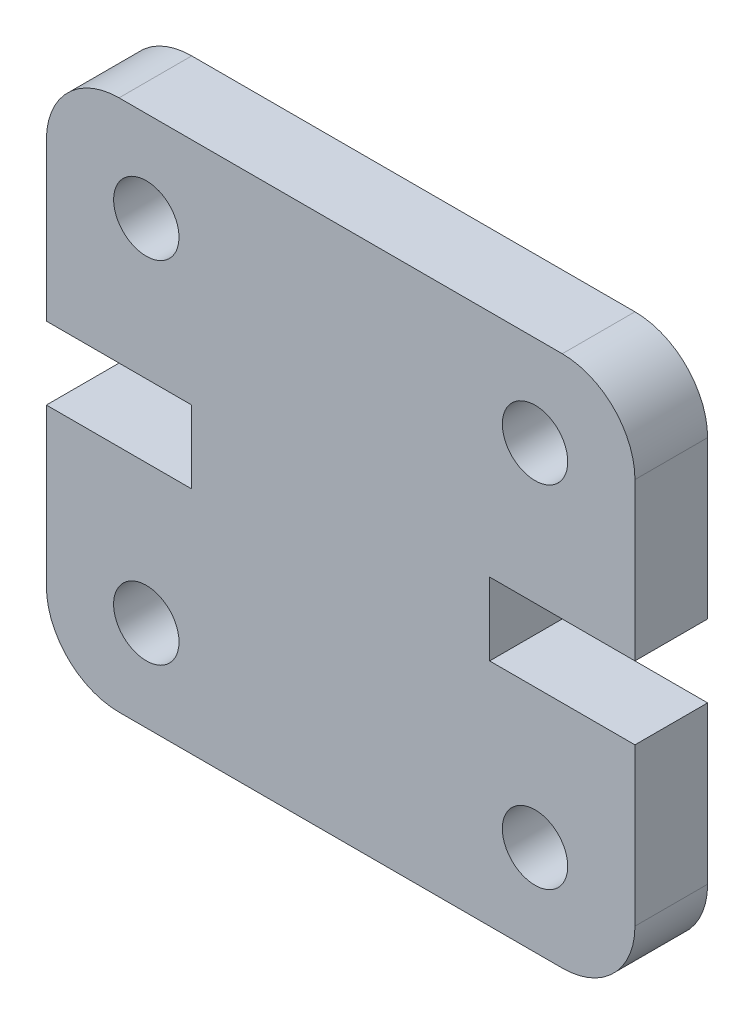
ISO-10303-21;
HEADER;
FILE_DESCRIPTION(('STEP AP214'),'2;1');
FILE_NAME('part.step','',(''),(''),'','','');
FILE_SCHEMA(('AUTOMOTIVE_DESIGN { 1 0 10303 214 1 1 1 1 }'));
ENDSEC;
DATA;
#1=APPLICATION_CONTEXT('core data for automotive mechanical design processes');
#2=APPLICATION_PROTOCOL_DEFINITION('international standard','automotive_design',2000,#1);
#3=PRODUCT_CONTEXT('',#1,'mechanical');
#4=PRODUCT('Part','Part','',(#3));
#5=PRODUCT_RELATED_PRODUCT_CATEGORY('part','',(#4));
#6=PRODUCT_DEFINITION_FORMATION('','',#4);
#7=PRODUCT_DEFINITION_CONTEXT('part definition',#1,'design');
#8=PRODUCT_DEFINITION('design','',#6,#7);
#9=PRODUCT_DEFINITION_SHAPE('','',#8);
#10=(LENGTH_UNIT() NAMED_UNIT(*) SI_UNIT(.MILLI.,.METRE.));
#11=(NAMED_UNIT(*) PLANE_ANGLE_UNIT() SI_UNIT($,.RADIAN.));
#12=(NAMED_UNIT(*) SI_UNIT($,.STERADIAN.) SOLID_ANGLE_UNIT());
#13=UNCERTAINTY_MEASURE_WITH_UNIT(LENGTH_MEASURE(1.E-05),#10,'distance_accuracy_value','');
#14=(GEOMETRIC_REPRESENTATION_CONTEXT(3) GLOBAL_UNCERTAINTY_ASSIGNED_CONTEXT((#13)) GLOBAL_UNIT_ASSIGNED_CONTEXT((#10,
#11,#12)) REPRESENTATION_CONTEXT('',''));
#15=CARTESIAN_POINT('',(0.,0.,0.));
#16=DIRECTION('',(0.,0.,1.));
#17=DIRECTION('',(1.,0.,0.));
#18=AXIS2_PLACEMENT_3D('',#15,#16,#17);
#19=CARTESIAN_POINT('',(2.,12.645,4.));
#20=DIRECTION('',(0.,0.,-1.));
#21=DIRECTION('',(-1.,0.,0.));
#22=AXIS2_PLACEMENT_3D('',#19,#20,#21);
#23=PLANE('',#22);
#24=CARTESIAN_POINT('',(13.4499999999986,12.1450000000001,4.));
#25=DIRECTION('',(0.,0.,1.));
#26=DIRECTION('',(1.,0.,0.));
#27=AXIS2_PLACEMENT_3D('',#24,#25,#26);
#28=CIRCLE('',#27,0.9);
#29=CARTESIAN_POINT('',(14.3499999999986,12.1450000000001,4.));
#30=VERTEX_POINT('',#29);
#31=EDGE_CURVE('E239',#30,#30,#28,.T.);
#32=ORIENTED_EDGE('',*,*,#31,.F.);
#33=EDGE_LOOP('',(#32));
#34=FACE_BOUND('',#33,.T.);
#35=CARTESIAN_POINT('',(2.75000000000139,12.1450000000001,4.));
#36=DIRECTION('',(0.,0.,1.));
#37=DIRECTION('',(-1.,0.,0.));
#38=AXIS2_PLACEMENT_3D('',#35,#36,#37);
#39=CIRCLE('',#38,0.9);
#40=CARTESIAN_POINT('',(1.85000000000139,12.1450000000001,4.));
#41=VERTEX_POINT('',#40);
#42=EDGE_CURVE('E245',#41,#41,#39,.T.);
#43=ORIENTED_EDGE('',*,*,#42,.F.);
#44=EDGE_LOOP('',(#43));
#45=FACE_BOUND('',#44,.T.);
#46=CARTESIAN_POINT('',(2.,12.645,4.));
#47=DIRECTION('',(0.,0.,1.));
#48=DIRECTION('',(-1.,0.,0.));
#49=AXIS2_PLACEMENT_3D('',#46,#47,#48);
#50=CIRCLE('',#49,2.);
#51=CARTESIAN_POINT('',(2.,14.645,4.));
#52=VERTEX_POINT('',#51);
#53=CARTESIAN_POINT('',(0.,12.645,4.));
#54=VERTEX_POINT('',#53);
#55=EDGE_CURVE('E248',#52,#54,#50,.T.);
#56=ORIENTED_EDGE('',*,*,#55,.T.);
#57=DIRECTION('',(0.,-1.,0.));
#58=VECTOR('',#57,1.);
#59=CARTESIAN_POINT('',(0.,8.3225,4.));
#60=LINE('',#59,#58);
#61=CARTESIAN_POINT('',(0.,8.3225,4.));
#62=VERTEX_POINT('',#61);
#63=EDGE_CURVE('E199',#54,#62,#60,.T.);
#64=ORIENTED_EDGE('',*,*,#63,.T.);
#65=DIRECTION('',(1.,0.,0.));
#66=VECTOR('',#65,1.);
#67=CARTESIAN_POINT('',(0.,8.3225,4.));
#68=LINE('',#67,#66);
#69=CARTESIAN_POINT('',(4.,8.3225,4.));
#70=VERTEX_POINT('',#69);
#71=EDGE_CURVE('E195',#62,#70,#68,.T.);
#72=ORIENTED_EDGE('',*,*,#71,.T.);
#73=DIRECTION('',(0.,-1.,0.));
#74=VECTOR('',#73,1.);
#75=CARTESIAN_POINT('',(4.,6.3225,4.));
#76=LINE('',#75,#74);
#77=CARTESIAN_POINT('',(4.,6.3225,4.));
#78=VERTEX_POINT('',#77);
#79=EDGE_CURVE('E252',#70,#78,#76,.T.);
#80=ORIENTED_EDGE('',*,*,#79,.T.);
#81=DIRECTION('',(-1.,0.,0.));
#82=VECTOR('',#81,1.);
#83=CARTESIAN_POINT('',(0.,6.3225,4.));
#84=LINE('',#83,#82);
#85=CARTESIAN_POINT('',(0.,6.3225,4.));
#86=VERTEX_POINT('',#85);
#87=EDGE_CURVE('E254',#78,#86,#84,.T.);
#88=ORIENTED_EDGE('',*,*,#87,.T.);
#89=DIRECTION('',(0.,-1.,0.));
#90=VECTOR('',#89,1.);
#91=CARTESIAN_POINT('',(0.,6.3225,4.));
#92=LINE('',#91,#90);
#93=CARTESIAN_POINT('',(0.,2.00000000000003,4.));
#94=VERTEX_POINT('',#93);
#95=EDGE_CURVE('E256',#86,#94,#92,.T.);
#96=ORIENTED_EDGE('',*,*,#95,.T.);
#97=CARTESIAN_POINT('',(2.,2.,4.));
#98=DIRECTION('',(0.,0.,1.));
#99=DIRECTION('',(1.,0.,0.));
#100=AXIS2_PLACEMENT_3D('',#97,#98,#99);
#101=CIRCLE('',#100,2.);
#102=CARTESIAN_POINT('',(2.,0.,4.));
#103=VERTEX_POINT('',#102);
#104=EDGE_CURVE('E173',#94,#103,#101,.T.);
#105=ORIENTED_EDGE('',*,*,#104,.T.);
#106=DIRECTION('',(1.,0.,0.));
#107=VECTOR('',#106,1.);
#108=CARTESIAN_POINT('',(2.,0.,4.));
#109=LINE('',#108,#107);
#110=CARTESIAN_POINT('',(14.2,0.,4.));
#111=VERTEX_POINT('',#110);
#112=EDGE_CURVE('E259',#103,#111,#109,.T.);
#113=ORIENTED_EDGE('',*,*,#112,.T.);
#114=CARTESIAN_POINT('',(14.2,2.,4.));
#115=DIRECTION('',(0.,0.,1.));
#116=DIRECTION('',(-1.,0.,0.));
#117=AXIS2_PLACEMENT_3D('',#114,#115,#116);
#118=CIRCLE('',#117,2.);
#119=CARTESIAN_POINT('',(16.2,2.00000000000003,4.));
#120=VERTEX_POINT('',#119);
#121=EDGE_CURVE('E261',#111,#120,#118,.T.);
#122=ORIENTED_EDGE('',*,*,#121,.T.);
#123=DIRECTION('',(0.,1.,0.));
#124=VECTOR('',#123,1.);
#125=CARTESIAN_POINT('',(16.2,6.3225,4.));
#126=LINE('',#125,#124);
#127=CARTESIAN_POINT('',(16.2,6.3225,4.));
#128=VERTEX_POINT('',#127);
#129=EDGE_CURVE('E263',#120,#128,#126,.T.);
#130=ORIENTED_EDGE('',*,*,#129,.T.);
#131=DIRECTION('',(-1.,0.,0.));
#132=VECTOR('',#131,1.);
#133=CARTESIAN_POINT('',(16.2,6.3225,4.));
#134=LINE('',#133,#132);
#135=CARTESIAN_POINT('',(12.2,6.3225,4.));
#136=VERTEX_POINT('',#135);
#137=EDGE_CURVE('E265',#128,#136,#134,.T.);
#138=ORIENTED_EDGE('',*,*,#137,.T.);
#139=DIRECTION('',(0.,1.,0.));
#140=VECTOR('',#139,1.);
#141=CARTESIAN_POINT('',(12.2,6.3225,4.));
#142=LINE('',#141,#140);
#143=CARTESIAN_POINT('',(12.2,8.3225,4.));
#144=VERTEX_POINT('',#143);
#145=EDGE_CURVE('E267',#136,#144,#142,.T.);
#146=ORIENTED_EDGE('',*,*,#145,.T.);
#147=DIRECTION('',(1.,0.,0.));
#148=VECTOR('',#147,1.);
#149=CARTESIAN_POINT('',(16.2,8.3225,4.));
#150=LINE('',#149,#148);
#151=CARTESIAN_POINT('',(16.2,8.3225,4.));
#152=VERTEX_POINT('',#151);
#153=EDGE_CURVE('E269',#144,#152,#150,.T.);
#154=ORIENTED_EDGE('',*,*,#153,.T.);
#155=DIRECTION('',(0.,1.,0.));
#156=VECTOR('',#155,1.);
#157=CARTESIAN_POINT('',(16.2,8.3225,4.));
#158=LINE('',#157,#156);
#159=CARTESIAN_POINT('',(16.2,12.645,4.));
#160=VERTEX_POINT('',#159);
#161=EDGE_CURVE('E271',#152,#160,#158,.T.);
#162=ORIENTED_EDGE('',*,*,#161,.T.);
#163=CARTESIAN_POINT('',(14.2,12.645,4.));
#164=DIRECTION('',(0.,0.,1.));
#165=DIRECTION('',(1.,0.,0.));
#166=AXIS2_PLACEMENT_3D('',#163,#164,#165);
#167=CIRCLE('',#166,2.);
#168=CARTESIAN_POINT('',(14.2,14.645,4.));
#169=VERTEX_POINT('',#168);
#170=EDGE_CURVE('E273',#160,#169,#167,.T.);
#171=ORIENTED_EDGE('',*,*,#170,.T.);
#172=DIRECTION('',(-1.,0.,0.));
#173=VECTOR('',#172,1.);
#174=CARTESIAN_POINT('',(2.,14.645,4.));
#175=LINE('',#174,#173);
#176=EDGE_CURVE('E57',#169,#52,#175,.T.);
#177=ORIENTED_EDGE('',*,*,#176,.T.);
#178=EDGE_LOOP('',(#56,#64,#72,#80,#88,#96,#105,#113,#122,#130,#138,#146,#154,#162,#171,#177));
#179=FACE_BOUND('',#178,.T.);
#180=CARTESIAN_POINT('',(13.4499999999986,2.4999999999999,4.));
#181=DIRECTION('',(0.,0.,1.));
#182=DIRECTION('',(-1.,0.,0.));
#183=AXIS2_PLACEMENT_3D('',#180,#181,#182);
#184=CIRCLE('',#183,0.9);
#185=CARTESIAN_POINT('',(12.5499999999986,2.4999999999999,4.));
#186=VERTEX_POINT('',#185);
#187=EDGE_CURVE('E242',#186,#186,#184,.T.);
#188=ORIENTED_EDGE('',*,*,#187,.F.);
#189=EDGE_LOOP('',(#188));
#190=FACE_BOUND('',#189,.T.);
#191=CARTESIAN_POINT('',(2.75000000000139,2.4999999999999,4.));
#192=DIRECTION('',(0.,0.,1.));
#193=DIRECTION('',(1.,0.,0.));
#194=AXIS2_PLACEMENT_3D('',#191,#192,#193);
#195=CIRCLE('',#194,0.9);
#196=CARTESIAN_POINT('',(3.65000000000139,2.4999999999999,4.));
#197=VERTEX_POINT('',#196);
#198=EDGE_CURVE('E236',#197,#197,#195,.T.);
#199=ORIENTED_EDGE('',*,*,#198,.F.);
#200=EDGE_LOOP('',(#199));
#201=FACE_BOUND('',#200,.T.);
#202=ADVANCED_FACE('F33',(#34,#45,#179,#190,#201),#23,.F.);
#203=CARTESIAN_POINT('',(2.,12.645,4.));
#204=DIRECTION('',(0.,0.,-1.));
#205=DIRECTION('',(-1.,0.,0.));
#206=AXIS2_PLACEMENT_3D('',#203,#204,#205);
#207=CYLINDRICAL_SURFACE('',#206,2.);
#208=DIRECTION('',(0.,0.,-1.));
#209=VECTOR('',#208,1.);
#210=CARTESIAN_POINT('',(2.,14.645,4.));
#211=LINE('',#210,#209);
#212=CARTESIAN_POINT('',(2.,14.645,2.));
#213=VERTEX_POINT('',#212);
#214=EDGE_CURVE('E276',#52,#213,#211,.T.);
#215=ORIENTED_EDGE('',*,*,#214,.T.);
#216=CARTESIAN_POINT('',(2.,12.645,2.));
#217=DIRECTION('',(0.,0.,1.));
#218=DIRECTION('',(1.,0.,0.));
#219=AXIS2_PLACEMENT_3D('',#216,#217,#218);
#220=CIRCLE('',#219,2.);
#221=CARTESIAN_POINT('',(0.,12.645,2.));
#222=VERTEX_POINT('',#221);
#223=EDGE_CURVE('E49',#213,#222,#220,.T.);
#224=ORIENTED_EDGE('',*,*,#223,.T.);
#225=DIRECTION('',(0.,0.,-1.));
#226=VECTOR('',#225,1.);
#227=CARTESIAN_POINT('',(0.,12.645,4.));
#228=LINE('',#227,#226);
#229=EDGE_CURVE('E11',#54,#222,#228,.T.);
#230=ORIENTED_EDGE('',*,*,#229,.F.);
#231=ORIENTED_EDGE('',*,*,#55,.F.);
#232=EDGE_LOOP('',(#215,#224,#230,#231));
#233=FACE_BOUND('',#232,.T.);
#234=ADVANCED_FACE('F35',(#233),#207,.T.);
#235=CARTESIAN_POINT('',(0.,8.3225,4.));
#236=DIRECTION('',(1.,0.,0.));
#237=DIRECTION('',(0.,1.,0.));
#238=AXIS2_PLACEMENT_3D('',#235,#236,#237);
#239=PLANE('',#238);
#240=ORIENTED_EDGE('',*,*,#229,.T.);
#241=DIRECTION('',(0.,1.,0.));
#242=VECTOR('',#241,1.);
#243=CARTESIAN_POINT('',(0.,14.645,2.));
#244=LINE('',#243,#242);
#245=CARTESIAN_POINT('',(0.,8.3225,2.));
#246=VERTEX_POINT('',#245);
#247=EDGE_CURVE('E170',#246,#222,#244,.T.);
#248=ORIENTED_EDGE('',*,*,#247,.F.);
#249=DIRECTION('',(0.,0.,-1.));
#250=VECTOR('',#249,1.);
#251=CARTESIAN_POINT('',(0.,8.3225,4.));
#252=LINE('',#251,#250);
#253=EDGE_CURVE('E42',#62,#246,#252,.T.);
#254=ORIENTED_EDGE('',*,*,#253,.F.);
#255=ORIENTED_EDGE('',*,*,#63,.F.);
#256=EDGE_LOOP('',(#240,#248,#254,#255));
#257=FACE_BOUND('',#256,.T.);
#258=ADVANCED_FACE('F198',(#257),#239,.F.);
#259=CARTESIAN_POINT('',(0.,8.3225,4.));
#260=DIRECTION('',(0.,1.,0.));
#261=DIRECTION('',(0.,0.,1.));
#262=AXIS2_PLACEMENT_3D('',#259,#260,#261);
#263=PLANE('',#262);
#264=ORIENTED_EDGE('',*,*,#253,.T.);
#265=DIRECTION('',(1.,0.,0.));
#266=VECTOR('',#265,1.);
#267=CARTESIAN_POINT('',(0.,8.3225,2.));
#268=LINE('',#267,#266);
#269=CARTESIAN_POINT('',(4.,8.3225,2.));
#270=VERTEX_POINT('',#269);
#271=EDGE_CURVE('E194',#246,#270,#268,.T.);
#272=ORIENTED_EDGE('',*,*,#271,.T.);
#273=DIRECTION('',(0.,0.,-1.));
#274=VECTOR('',#273,1.);
#275=CARTESIAN_POINT('',(4.,8.3225,4.));
#276=LINE('',#275,#274);
#277=EDGE_CURVE('E184',#70,#270,#276,.T.);
#278=ORIENTED_EDGE('',*,*,#277,.F.);
#279=ORIENTED_EDGE('',*,*,#71,.F.);
#280=EDGE_LOOP('',(#264,#272,#278,#279));
#281=FACE_BOUND('',#280,.T.);
#282=ADVANCED_FACE('F192',(#281),#263,.F.);
#283=CARTESIAN_POINT('',(4.,6.3225,4.));
#284=DIRECTION('',(1.,0.,0.));
#285=DIRECTION('',(0.,0.,-1.));
#286=AXIS2_PLACEMENT_3D('',#283,#284,#285);
#287=PLANE('',#286);
#288=ORIENTED_EDGE('',*,*,#277,.T.);
#289=DIRECTION('',(0.,-1.,0.));
#290=VECTOR('',#289,1.);
#291=CARTESIAN_POINT('',(4.,6.3225,2.));
#292=LINE('',#291,#290);
#293=CARTESIAN_POINT('',(4.,6.3225,2.));
#294=VERTEX_POINT('',#293);
#295=EDGE_CURVE('E231',#270,#294,#292,.T.);
#296=ORIENTED_EDGE('',*,*,#295,.T.);
#297=DIRECTION('',(0.,0.,-1.));
#298=VECTOR('',#297,1.);
#299=CARTESIAN_POINT('',(4.,6.3225,4.));
#300=LINE('',#299,#298);
#301=EDGE_CURVE('E176',#78,#294,#300,.T.);
#302=ORIENTED_EDGE('',*,*,#301,.F.);
#303=ORIENTED_EDGE('',*,*,#79,.F.);
#304=EDGE_LOOP('',(#288,#296,#302,#303));
#305=FACE_BOUND('',#304,.T.);
#306=ADVANCED_FACE('F315',(#305),#287,.F.);
#307=CARTESIAN_POINT('',(0.,6.3225,4.));
#308=DIRECTION('',(0.,-1.,0.));
#309=DIRECTION('',(0.,0.,-1.));
#310=AXIS2_PLACEMENT_3D('',#307,#308,#309);
#311=PLANE('',#310);
#312=ORIENTED_EDGE('',*,*,#301,.T.);
#313=DIRECTION('',(-1.,0.,0.));
#314=VECTOR('',#313,1.);
#315=CARTESIAN_POINT('',(0.,6.3225,2.));
#316=LINE('',#315,#314);
#317=CARTESIAN_POINT('',(0.,6.3225,2.));
#318=VERTEX_POINT('',#317);
#319=EDGE_CURVE('E157',#294,#318,#316,.T.);
#320=ORIENTED_EDGE('',*,*,#319,.T.);
#321=DIRECTION('',(0.,0.,-1.));
#322=VECTOR('',#321,1.);
#323=CARTESIAN_POINT('',(0.,6.3225,4.));
#324=LINE('',#323,#322);
#325=EDGE_CURVE('E168',#86,#318,#324,.T.);
#326=ORIENTED_EDGE('',*,*,#325,.F.);
#327=ORIENTED_EDGE('',*,*,#87,.F.);
#328=EDGE_LOOP('',(#312,#320,#326,#327));
#329=FACE_BOUND('',#328,.T.);
#330=ADVANCED_FACE('F313',(#329),#311,.F.);
#331=CARTESIAN_POINT('',(0.,6.3225,4.));
#332=DIRECTION('',(1.,0.,0.));
#333=DIRECTION('',(0.,1.,0.));
#334=AXIS2_PLACEMENT_3D('',#331,#332,#333);
#335=PLANE('',#334);
#336=ORIENTED_EDGE('',*,*,#325,.T.);
#337=CARTESIAN_POINT('',(0.,2.,2.));
#338=VERTEX_POINT('',#337);
#339=EDGE_CURVE('E149',#338,#318,#244,.T.);
#340=ORIENTED_EDGE('',*,*,#339,.F.);
#341=DIRECTION('',(0.,0.,-1.));
#342=VECTOR('',#341,1.);
#343=CARTESIAN_POINT('',(0.,2.00000000000003,4.));
#344=LINE('',#343,#342);
#345=EDGE_CURVE('E165',#94,#338,#344,.T.);
#346=ORIENTED_EDGE('',*,*,#345,.F.);
#347=ORIENTED_EDGE('',*,*,#95,.F.);
#348=EDGE_LOOP('',(#336,#340,#346,#347));
#349=FACE_BOUND('',#348,.T.);
#350=ADVANCED_FACE('F163',(#349),#335,.F.);
#351=CARTESIAN_POINT('',(2.,2.,4.));
#352=DIRECTION('',(0.,0.,-1.));
#353=DIRECTION('',(-1.,0.,0.));
#354=AXIS2_PLACEMENT_3D('',#351,#352,#353);
#355=CYLINDRICAL_SURFACE('',#354,2.);
#356=ORIENTED_EDGE('',*,*,#345,.T.);
#357=CARTESIAN_POINT('',(2.,2.,2.));
#358=DIRECTION('',(0.,0.,1.));
#359=DIRECTION('',(1.,0.,0.));
#360=AXIS2_PLACEMENT_3D('',#357,#358,#359);
#361=CIRCLE('',#360,2.);
#362=CARTESIAN_POINT('',(2.,0.,2.));
#363=VERTEX_POINT('',#362);
#364=EDGE_CURVE('E146',#338,#363,#361,.T.);
#365=ORIENTED_EDGE('',*,*,#364,.T.);
#366=DIRECTION('',(0.,0.,-1.));
#367=VECTOR('',#366,1.);
#368=CARTESIAN_POINT('',(2.,0.,4.));
#369=LINE('',#368,#367);
#370=EDGE_CURVE('E174',#103,#363,#369,.T.);
#371=ORIENTED_EDGE('',*,*,#370,.F.);
#372=ORIENTED_EDGE('',*,*,#104,.F.);
#373=EDGE_LOOP('',(#356,#365,#371,#372));
#374=FACE_BOUND('',#373,.T.);
#375=ADVANCED_FACE('F172',(#374),#355,.T.);
#376=CARTESIAN_POINT('',(2.,0.,4.));
#377=DIRECTION('',(0.,1.,0.));
#378=DIRECTION('',(-1.,0.,0.));
#379=AXIS2_PLACEMENT_3D('',#376,#377,#378);
#380=PLANE('',#379);
#381=ORIENTED_EDGE('',*,*,#370,.T.);
#382=DIRECTION('',(-1.,0.,0.));
#383=VECTOR('',#382,1.);
#384=CARTESIAN_POINT('',(0.,0.,2.));
#385=LINE('',#384,#383);
#386=CARTESIAN_POINT('',(14.2,0.,2.));
#387=VERTEX_POINT('',#386);
#388=EDGE_CURVE('E152',#387,#363,#385,.T.);
#389=ORIENTED_EDGE('',*,*,#388,.F.);
#390=DIRECTION('',(0.,0.,-1.));
#391=VECTOR('',#390,1.);
#392=CARTESIAN_POINT('',(14.2,0.,4.));
#393=LINE('',#392,#391);
#394=EDGE_CURVE('E178',#111,#387,#393,.T.);
#395=ORIENTED_EDGE('',*,*,#394,.F.);
#396=ORIENTED_EDGE('',*,*,#112,.F.);
#397=EDGE_LOOP('',(#381,#389,#395,#396));
#398=FACE_BOUND('',#397,.T.);
#399=ADVANCED_FACE('F307',(#398),#380,.F.);
#400=CARTESIAN_POINT('',(14.2,2.,4.));
#401=DIRECTION('',(0.,0.,-1.));
#402=DIRECTION('',(-1.,0.,0.));
#403=AXIS2_PLACEMENT_3D('',#400,#401,#402);
#404=CYLINDRICAL_SURFACE('',#403,2.);
#405=ORIENTED_EDGE('',*,*,#394,.T.);
#406=CARTESIAN_POINT('',(14.2,2.,2.));
#407=DIRECTION('',(0.,0.,1.));
#408=DIRECTION('',(1.,0.,0.));
#409=AXIS2_PLACEMENT_3D('',#406,#407,#408);
#410=CIRCLE('',#409,2.);
#411=CARTESIAN_POINT('',(16.2,2.00000000000003,2.));
#412=VERTEX_POINT('',#411);
#413=EDGE_CURVE('E158',#387,#412,#410,.T.);
#414=ORIENTED_EDGE('',*,*,#413,.T.);
#415=DIRECTION('',(0.,0.,-1.));
#416=VECTOR('',#415,1.);
#417=CARTESIAN_POINT('',(16.2,2.00000000000003,4.));
#418=LINE('',#417,#416);
#419=EDGE_CURVE('E297',#120,#412,#418,.T.);
#420=ORIENTED_EDGE('',*,*,#419,.F.);
#421=ORIENTED_EDGE('',*,*,#121,.F.);
#422=EDGE_LOOP('',(#405,#414,#420,#421));
#423=FACE_BOUND('',#422,.T.);
#424=ADVANCED_FACE('F303',(#423),#404,.T.);
#425=CARTESIAN_POINT('',(16.2,6.3225,4.));
#426=DIRECTION('',(-1.,0.,0.));
#427=DIRECTION('',(0.,-1.,0.));
#428=AXIS2_PLACEMENT_3D('',#425,#426,#427);
#429=PLANE('',#428);
#430=ORIENTED_EDGE('',*,*,#419,.T.);
#431=DIRECTION('',(0.,-1.,0.));
#432=VECTOR('',#431,1.);
#433=CARTESIAN_POINT('',(16.2,0.,2.));
#434=LINE('',#433,#432);
#435=CARTESIAN_POINT('',(16.2,6.3225,2.));
#436=VERTEX_POINT('',#435);
#437=EDGE_CURVE('E203',#436,#412,#434,.T.);
#438=ORIENTED_EDGE('',*,*,#437,.F.);
#439=DIRECTION('',(0.,0.,-1.));
#440=VECTOR('',#439,1.);
#441=CARTESIAN_POINT('',(16.2,6.3225,4.));
#442=LINE('',#441,#440);
#443=EDGE_CURVE('E294',#128,#436,#442,.T.);
#444=ORIENTED_EDGE('',*,*,#443,.F.);
#445=ORIENTED_EDGE('',*,*,#129,.F.);
#446=EDGE_LOOP('',(#430,#438,#444,#445));
#447=FACE_BOUND('',#446,.T.);
#448=ADVANCED_FACE('F360',(#447),#429,.F.);
#449=CARTESIAN_POINT('',(16.2,6.3225,4.));
#450=DIRECTION('',(0.,-1.,0.));
#451=DIRECTION('',(0.,0.,-1.));
#452=AXIS2_PLACEMENT_3D('',#449,#450,#451);
#453=PLANE('',#452);
#454=ORIENTED_EDGE('',*,*,#443,.T.);
#455=DIRECTION('',(-1.,0.,0.));
#456=VECTOR('',#455,1.);
#457=CARTESIAN_POINT('',(16.2,6.3225,2.));
#458=LINE('',#457,#456);
#459=CARTESIAN_POINT('',(12.2,6.3225,2.));
#460=VERTEX_POINT('',#459);
#461=EDGE_CURVE('E225',#436,#460,#458,.T.);
#462=ORIENTED_EDGE('',*,*,#461,.T.);
#463=DIRECTION('',(0.,0.,-1.));
#464=VECTOR('',#463,1.);
#465=CARTESIAN_POINT('',(12.2,6.3225,4.));
#466=LINE('',#465,#464);
#467=EDGE_CURVE('E291',#136,#460,#466,.T.);
#468=ORIENTED_EDGE('',*,*,#467,.F.);
#469=ORIENTED_EDGE('',*,*,#137,.F.);
#470=EDGE_LOOP('',(#454,#462,#468,#469));
#471=FACE_BOUND('',#470,.T.);
#472=ADVANCED_FACE('F356',(#471),#453,.F.);
#473=CARTESIAN_POINT('',(12.2,6.3225,4.));
#474=DIRECTION('',(-1.,0.,0.));
#475=DIRECTION('',(0.,0.,1.));
#476=AXIS2_PLACEMENT_3D('',#473,#474,#475);
#477=PLANE('',#476);
#478=ORIENTED_EDGE('',*,*,#467,.T.);
#479=DIRECTION('',(0.,1.,0.));
#480=VECTOR('',#479,1.);
#481=CARTESIAN_POINT('',(12.2,6.3225,2.));
#482=LINE('',#481,#480);
#483=CARTESIAN_POINT('',(12.2,8.3225,2.));
#484=VERTEX_POINT('',#483);
#485=EDGE_CURVE('E222',#460,#484,#482,.T.);
#486=ORIENTED_EDGE('',*,*,#485,.T.);
#487=DIRECTION('',(0.,0.,-1.));
#488=VECTOR('',#487,1.);
#489=CARTESIAN_POINT('',(12.2,8.3225,4.));
#490=LINE('',#489,#488);
#491=EDGE_CURVE('E288',#144,#484,#490,.T.);
#492=ORIENTED_EDGE('',*,*,#491,.F.);
#493=ORIENTED_EDGE('',*,*,#145,.F.);
#494=EDGE_LOOP('',(#478,#486,#492,#493));
#495=FACE_BOUND('',#494,.T.);
#496=ADVANCED_FACE('F352',(#495),#477,.F.);
#497=CARTESIAN_POINT('',(16.2,8.3225,4.));
#498=DIRECTION('',(0.,1.,0.));
#499=DIRECTION('',(0.,0.,1.));
#500=AXIS2_PLACEMENT_3D('',#497,#498,#499);
#501=PLANE('',#500);
#502=ORIENTED_EDGE('',*,*,#491,.T.);
#503=DIRECTION('',(1.,0.,0.));
#504=VECTOR('',#503,1.);
#505=CARTESIAN_POINT('',(16.2,8.3225,2.));
#506=LINE('',#505,#504);
#507=CARTESIAN_POINT('',(16.2,8.3225,2.));
#508=VERTEX_POINT('',#507);
#509=EDGE_CURVE('E219',#484,#508,#506,.T.);
#510=ORIENTED_EDGE('',*,*,#509,.T.);
#511=DIRECTION('',(0.,0.,-1.));
#512=VECTOR('',#511,1.);
#513=CARTESIAN_POINT('',(16.2,8.3225,4.));
#514=LINE('',#513,#512);
#515=EDGE_CURVE('E285',#152,#508,#514,.T.);
#516=ORIENTED_EDGE('',*,*,#515,.F.);
#517=ORIENTED_EDGE('',*,*,#153,.F.);
#518=EDGE_LOOP('',(#502,#510,#516,#517));
#519=FACE_BOUND('',#518,.T.);
#520=ADVANCED_FACE('F348',(#519),#501,.F.);
#521=CARTESIAN_POINT('',(16.2,8.3225,4.));
#522=DIRECTION('',(-1.,0.,0.));
#523=DIRECTION('',(0.,-1.,0.));
#524=AXIS2_PLACEMENT_3D('',#521,#522,#523);
#525=PLANE('',#524);
#526=ORIENTED_EDGE('',*,*,#515,.T.);
#527=CARTESIAN_POINT('',(16.2,12.645,2.));
#528=VERTEX_POINT('',#527);
#529=EDGE_CURVE('E205',#528,#508,#434,.T.);
#530=ORIENTED_EDGE('',*,*,#529,.F.);
#531=DIRECTION('',(0.,0.,-1.));
#532=VECTOR('',#531,1.);
#533=CARTESIAN_POINT('',(16.2,12.645,4.));
#534=LINE('',#533,#532);
#535=EDGE_CURVE('E282',#160,#528,#534,.T.);
#536=ORIENTED_EDGE('',*,*,#535,.F.);
#537=ORIENTED_EDGE('',*,*,#161,.F.);
#538=EDGE_LOOP('',(#526,#530,#536,#537));
#539=FACE_BOUND('',#538,.T.);
#540=ADVANCED_FACE('F344',(#539),#525,.F.);
#541=CARTESIAN_POINT('',(14.2,12.645,4.));
#542=DIRECTION('',(0.,0.,-1.));
#543=DIRECTION('',(-1.,0.,0.));
#544=AXIS2_PLACEMENT_3D('',#541,#542,#543);
#545=CYLINDRICAL_SURFACE('',#544,2.);
#546=ORIENTED_EDGE('',*,*,#535,.T.);
#547=CARTESIAN_POINT('',(14.2,12.645,2.));
#548=DIRECTION('',(0.,0.,1.));
#549=DIRECTION('',(1.,0.,0.));
#550=AXIS2_PLACEMENT_3D('',#547,#548,#549);
#551=CIRCLE('',#550,2.);
#552=CARTESIAN_POINT('',(14.2,14.645,2.));
#553=VERTEX_POINT('',#552);
#554=EDGE_CURVE('E216',#528,#553,#551,.T.);
#555=ORIENTED_EDGE('',*,*,#554,.T.);
#556=DIRECTION('',(0.,0.,-1.));
#557=VECTOR('',#556,1.);
#558=CARTESIAN_POINT('',(14.2,14.645,4.));
#559=LINE('',#558,#557);
#560=EDGE_CURVE('E279',#169,#553,#559,.T.);
#561=ORIENTED_EDGE('',*,*,#560,.F.);
#562=ORIENTED_EDGE('',*,*,#170,.F.);
#563=EDGE_LOOP('',(#546,#555,#561,#562));
#564=FACE_BOUND('',#563,.T.);
#565=ADVANCED_FACE('F340',(#564),#545,.T.);
#566=CARTESIAN_POINT('',(2.,14.645,4.));
#567=DIRECTION('',(0.,-1.,0.));
#568=DIRECTION('',(1.,0.,0.));
#569=AXIS2_PLACEMENT_3D('',#566,#567,#568);
#570=PLANE('',#569);
#571=ORIENTED_EDGE('',*,*,#560,.T.);
#572=DIRECTION('',(1.,0.,0.));
#573=VECTOR('',#572,1.);
#574=CARTESIAN_POINT('',(16.2,14.645,2.));
#575=LINE('',#574,#573);
#576=EDGE_CURVE('E169',#213,#553,#575,.T.);
#577=ORIENTED_EDGE('',*,*,#576,.F.);
#578=ORIENTED_EDGE('',*,*,#214,.F.);
#579=ORIENTED_EDGE('',*,*,#176,.F.);
#580=EDGE_LOOP('',(#571,#577,#578,#579));
#581=FACE_BOUND('',#580,.T.);
#582=ADVANCED_FACE('F337',(#581),#570,.F.);
#583=CARTESIAN_POINT('',(2.75000000000139,12.1450000000001,4.));
#584=DIRECTION('',(0.,0.,-1.));
#585=DIRECTION('',(-1.,0.,0.));
#586=AXIS2_PLACEMENT_3D('',#583,#584,#585);
#587=CYLINDRICAL_SURFACE('',#586,0.9);
#588=CARTESIAN_POINT('',(2.75000000000139,12.1450000000001,2.));
#589=DIRECTION('',(0.,0.,1.));
#590=DIRECTION('',(1.,0.,0.));
#591=AXIS2_PLACEMENT_3D('',#588,#589,#590);
#592=CIRCLE('',#591,0.9);
#593=CARTESIAN_POINT('',(3.65000000000139,12.1450000000001,2.));
#594=VERTEX_POINT('',#593);
#595=EDGE_CURVE('E213',#594,#594,#592,.T.);
#596=ORIENTED_EDGE('',*,*,#595,.F.);
#597=EDGE_LOOP('',(#596));
#598=FACE_BOUND('',#597,.T.);
#599=ORIENTED_EDGE('',*,*,#42,.T.);
#600=EDGE_LOOP('',(#599));
#601=FACE_BOUND('',#600,.T.);
#602=ADVANCED_FACE('F335',(#598,#601),#587,.F.);
#603=CARTESIAN_POINT('',(13.4499999999986,2.4999999999999,4.));
#604=DIRECTION('',(0.,0.,-1.));
#605=DIRECTION('',(-1.,0.,0.));
#606=AXIS2_PLACEMENT_3D('',#603,#604,#605);
#607=CYLINDRICAL_SURFACE('',#606,0.9);
#608=CARTESIAN_POINT('',(13.4499999999986,2.4999999999999,2.));
#609=DIRECTION('',(0.,0.,1.));
#610=DIRECTION('',(1.,0.,0.));
#611=AXIS2_PLACEMENT_3D('',#608,#609,#610);
#612=CIRCLE('',#611,0.9);
#613=CARTESIAN_POINT('',(14.3499999999986,2.4999999999999,2.));
#614=VERTEX_POINT('',#613);
#615=EDGE_CURVE('E210',#614,#614,#612,.T.);
#616=ORIENTED_EDGE('',*,*,#615,.F.);
#617=EDGE_LOOP('',(#616));
#618=FACE_BOUND('',#617,.T.);
#619=ORIENTED_EDGE('',*,*,#187,.T.);
#620=EDGE_LOOP('',(#619));
#621=FACE_BOUND('',#620,.T.);
#622=ADVANCED_FACE('F422',(#618,#621),#607,.F.);
#623=CARTESIAN_POINT('',(13.4499999999986,12.1450000000001,4.));
#624=DIRECTION('',(0.,0.,-1.));
#625=DIRECTION('',(-1.,0.,0.));
#626=AXIS2_PLACEMENT_3D('',#623,#624,#625);
#627=CYLINDRICAL_SURFACE('',#626,0.9);
#628=CARTESIAN_POINT('',(13.4499999999986,12.1450000000001,2.));
#629=DIRECTION('',(0.,0.,1.));
#630=DIRECTION('',(1.,0.,0.));
#631=AXIS2_PLACEMENT_3D('',#628,#629,#630);
#632=CIRCLE('',#631,0.9);
#633=CARTESIAN_POINT('',(14.3499999999986,12.1450000000001,2.));
#634=VERTEX_POINT('',#633);
#635=EDGE_CURVE('E207',#634,#634,#632,.T.);
#636=ORIENTED_EDGE('',*,*,#635,.F.);
#637=EDGE_LOOP('',(#636));
#638=FACE_BOUND('',#637,.T.);
#639=ORIENTED_EDGE('',*,*,#31,.T.);
#640=EDGE_LOOP('',(#639));
#641=FACE_BOUND('',#640,.T.);
#642=ADVANCED_FACE('F429',(#638,#641),#627,.F.);
#643=CARTESIAN_POINT('',(2.75000000000139,2.4999999999999,4.));
#644=DIRECTION('',(0.,0.,-1.));
#645=DIRECTION('',(-1.,0.,0.));
#646=AXIS2_PLACEMENT_3D('',#643,#644,#645);
#647=CYLINDRICAL_SURFACE('',#646,0.9);
#648=CARTESIAN_POINT('',(2.75000000000139,2.4999999999999,2.));
#649=DIRECTION('',(0.,0.,1.));
#650=DIRECTION('',(1.,0.,0.));
#651=AXIS2_PLACEMENT_3D('',#648,#649,#650);
#652=CIRCLE('',#651,0.9);
#653=CARTESIAN_POINT('',(3.65000000000139,2.4999999999999,2.));
#654=VERTEX_POINT('',#653);
#655=EDGE_CURVE('E37',#654,#654,#652,.T.);
#656=ORIENTED_EDGE('',*,*,#655,.F.);
#657=EDGE_LOOP('',(#656));
#658=FACE_BOUND('',#657,.T.);
#659=ORIENTED_EDGE('',*,*,#198,.T.);
#660=EDGE_LOOP('',(#659));
#661=FACE_BOUND('',#660,.T.);
#662=ADVANCED_FACE('F436',(#658,#661),#647,.F.);
#663=CARTESIAN_POINT('',(0.,0.,2.));
#664=DIRECTION('',(0.,0.,1.));
#665=DIRECTION('',(1.,0.,0.));
#666=AXIS2_PLACEMENT_3D('',#663,#664,#665);
#667=PLANE('',#666);
#668=ORIENTED_EDGE('',*,*,#595,.T.);
#669=EDGE_LOOP('',(#668));
#670=FACE_BOUND('',#669,.T.);
#671=ORIENTED_EDGE('',*,*,#615,.T.);
#672=EDGE_LOOP('',(#671));
#673=FACE_BOUND('',#672,.T.);
#674=ORIENTED_EDGE('',*,*,#635,.T.);
#675=EDGE_LOOP('',(#674));
#676=FACE_BOUND('',#675,.T.);
#677=ORIENTED_EDGE('',*,*,#655,.T.);
#678=EDGE_LOOP('',(#677));
#679=FACE_BOUND('',#678,.T.);
#680=ORIENTED_EDGE('',*,*,#576,.T.);
#681=ORIENTED_EDGE('',*,*,#554,.F.);
#682=ORIENTED_EDGE('',*,*,#529,.T.);
#683=ORIENTED_EDGE('',*,*,#509,.F.);
#684=ORIENTED_EDGE('',*,*,#485,.F.);
#685=ORIENTED_EDGE('',*,*,#461,.F.);
#686=ORIENTED_EDGE('',*,*,#437,.T.);
#687=ORIENTED_EDGE('',*,*,#413,.F.);
#688=ORIENTED_EDGE('',*,*,#388,.T.);
#689=ORIENTED_EDGE('',*,*,#364,.F.);
#690=ORIENTED_EDGE('',*,*,#339,.T.);
#691=ORIENTED_EDGE('',*,*,#319,.F.);
#692=ORIENTED_EDGE('',*,*,#295,.F.);
#693=ORIENTED_EDGE('',*,*,#271,.F.);
#694=ORIENTED_EDGE('',*,*,#247,.T.);
#695=ORIENTED_EDGE('',*,*,#223,.F.);
#696=EDGE_LOOP('',(#680,#681,#682,#683,#684,#685,#686,#687,#688,#689,#690,#691,#692,#693,#694,#695));
#697=FACE_BOUND('',#696,.T.);
#698=ADVANCED_FACE('F148',(#670,#673,#676,#679,#697),#667,.F.);
#699=CLOSED_SHELL('',(#202,#234,#258,#282,#306,#330,#350,#375,#399,#424,#448,#472,#496,#520,
#540,#565,#582,#602,#622,#642,#662,#698));
#700=MANIFOLD_SOLID_BREP('B2',#699);
#701=ADVANCED_BREP_SHAPE_REPRESENTATION('',(#18,#700),#14);
#702=SHAPE_DEFINITION_REPRESENTATION(#9,#701);
ENDSEC;
END-ISO-10303-21;
